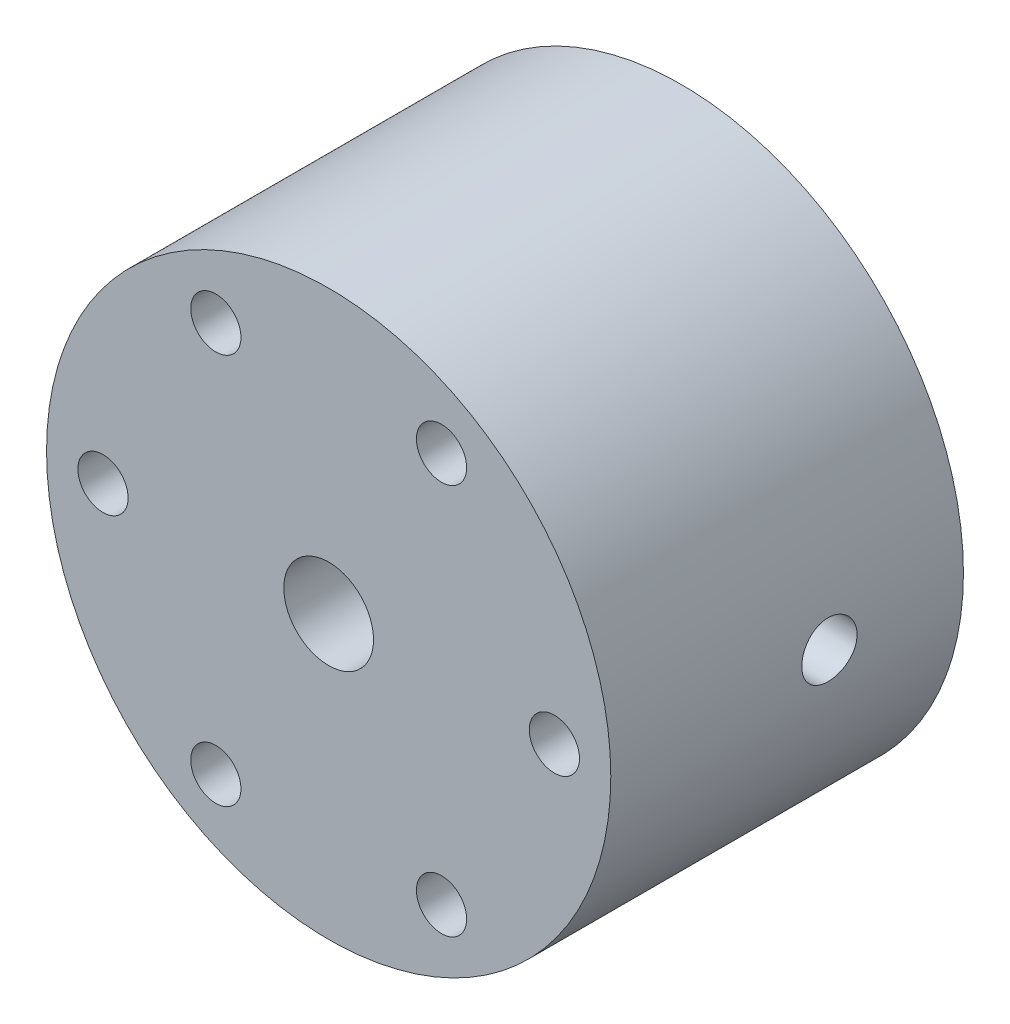
ISO-10303-21;
HEADER;
FILE_DESCRIPTION(('STEP AP214'),'2;1');
FILE_NAME('part.step','',(''),(''),'','','');
FILE_SCHEMA(('AUTOMOTIVE_DESIGN { 1 0 10303 214 1 1 1 1 }'));
ENDSEC;
DATA;
#1=APPLICATION_CONTEXT('core data for automotive mechanical design processes');
#2=APPLICATION_PROTOCOL_DEFINITION('international standard','automotive_design',2000,#1);
#3=PRODUCT_CONTEXT('',#1,'mechanical');
#4=PRODUCT('Part','Part','',(#3));
#5=PRODUCT_RELATED_PRODUCT_CATEGORY('part','',(#4));
#6=PRODUCT_DEFINITION_FORMATION('','',#4);
#7=PRODUCT_DEFINITION_CONTEXT('part definition',#1,'design');
#8=PRODUCT_DEFINITION('design','',#6,#7);
#9=PRODUCT_DEFINITION_SHAPE('','',#8);
#10=(LENGTH_UNIT() NAMED_UNIT(*) SI_UNIT(.MILLI.,.METRE.));
#11=(NAMED_UNIT(*) PLANE_ANGLE_UNIT() SI_UNIT($,.RADIAN.));
#12=(NAMED_UNIT(*) SI_UNIT($,.STERADIAN.) SOLID_ANGLE_UNIT());
#13=UNCERTAINTY_MEASURE_WITH_UNIT(LENGTH_MEASURE(1.E-05),#10,'distance_accuracy_value','');
#14=(GEOMETRIC_REPRESENTATION_CONTEXT(3) GLOBAL_UNCERTAINTY_ASSIGNED_CONTEXT((#13)) GLOBAL_UNIT_ASSIGNED_CONTEXT((#10,
#11,#12)) REPRESENTATION_CONTEXT('',''));
#15=CARTESIAN_POINT('',(0.,0.,0.));
#16=DIRECTION('',(0.,0.,1.));
#17=DIRECTION('',(1.,0.,0.));
#18=AXIS2_PLACEMENT_3D('',#15,#16,#17);
#19=CARTESIAN_POINT('',(0.,0.,-15.875));
#20=DIRECTION('',(0.,0.,1.));
#21=DIRECTION('',(1.,0.,0.));
#22=AXIS2_PLACEMENT_3D('',#19,#20,#21);
#23=CYLINDRICAL_SURFACE('',#22,6.35);
#24=CARTESIAN_POINT('',(6.35,0.,-11.0871));
#25=CARTESIAN_POINT('',(6.34999873012155,0.0691998501132355,-11.0870974209537));
#26=CARTESIAN_POINT('',(6.34885719759817,0.138432610376047,-11.0813092242111));
#27=CARTESIAN_POINT('',(6.34441347981327,0.274943160789766,-11.0583266188072));
#28=CARTESIAN_POINT('',(6.34110954309524,0.342219320002634,-11.0411229639482));
#29=CARTESIAN_POINT('',(6.33271016310304,0.472823044159895,-10.9958597295527));
#30=CARTESIAN_POINT('',(6.32761640429846,0.53615425609475,-10.9678103548511));
#31=CARTESIAN_POINT('',(6.31619193322287,0.657206847462699,-10.9016817866678));
#32=CARTESIAN_POINT('',(6.30986130322098,0.714928599620654,-10.8636032602054));
#33=CARTESIAN_POINT('',(6.29656824686096,0.823880845142603,-10.7779709838292));
#34=CARTESIAN_POINT('',(6.28959930751327,0.875027690644866,-10.7303118068963));
#35=CARTESIAN_POINT('',(6.2758627692415,0.968654169429386,-10.6270977837559));
#36=CARTESIAN_POINT('',(6.26909518565386,1.01113314395148,-10.5715423379742));
#37=CARTESIAN_POINT('',(6.25646410907387,1.08657144827613,-10.4535145404307));
#38=CARTESIAN_POINT('',(6.25060900192882,1.11944466141394,-10.3909861698795));
#39=CARTESIAN_POINT('',(6.24055807849484,1.17418673342534,-10.2611599746295));
#40=CARTESIAN_POINT('',(6.23636210514367,1.19605663398321,-10.1938626021008));
#41=CARTESIAN_POINT('',(6.23017031881125,1.2279007290091,-10.0573071032801));
#42=CARTESIAN_POINT('',(6.22814743858781,1.23802139891786,-9.98808438647694));
#43=CARTESIAN_POINT('',(6.22644936204592,1.24653460768439,-9.84889617228764));
#44=CARTESIAN_POINT('',(6.22677393536207,1.24492829735939,-9.77893074845929));
#45=CARTESIAN_POINT('',(6.22970948404262,1.23015168265358,-9.64131140134532));
#46=CARTESIAN_POINT('',(6.23228734628924,1.21714884796234,-9.5736386849708));
#47=CARTESIAN_POINT('',(6.23938691548407,1.18021243405689,-9.4414542143517));
#48=CARTESIAN_POINT('',(6.24390871193627,1.15627835153526,-9.37694260580546));
#49=CARTESIAN_POINT('',(6.254420759856,1.09799767249771,-9.25242656272007));
#50=CARTESIAN_POINT('',(6.26042038113394,1.06358429192835,-9.19245421072968));
#51=CARTESIAN_POINT('',(6.27320599878303,0.985369043358765,-9.07907245380946));
#52=CARTESIAN_POINT('',(6.27999208204964,0.941566137463435,-9.02566377543969));
#53=CARTESIAN_POINT('',(6.29372972798811,0.844916538812785,-8.92595868997348));
#54=CARTESIAN_POINT('',(6.30068212531286,0.791926810920896,-8.87980093796775));
#55=CARTESIAN_POINT('',(6.31386166816775,0.678884150310218,-8.79700789674848));
#56=CARTESIAN_POINT('',(6.32008880508828,0.618831133759667,-8.76037272057173));
#57=CARTESIAN_POINT('',(6.33113058236044,0.493215629932089,-8.69764083054893));
#58=CARTESIAN_POINT('',(6.33594315811733,0.427645267570471,-8.6715594996653));
#59=CARTESIAN_POINT('',(6.34359780845824,0.292938439507332,-8.63082098362483));
#60=CARTESIAN_POINT('',(6.34644011211744,0.22380238937774,-8.61616247036086));
#61=CARTESIAN_POINT('',(6.34980220790728,0.0851186705623439,-8.59888091246443));
#62=CARTESIAN_POINT('',(6.35035862750085,0.0155955163376805,-8.59606804268317));
#63=CARTESIAN_POINT('',(6.34918781510507,-0.122927488033901,-8.60204706092497));
#64=CARTESIAN_POINT('',(6.34746070618331,-0.191927366180502,-8.6108383235594));
#65=CARTESIAN_POINT('',(6.34193978026486,-0.326836136791517,-8.63961830912908));
#66=CARTESIAN_POINT('',(6.33816386674663,-0.392766510365615,-8.65951007259558));
#67=CARTESIAN_POINT('',(6.32896709967917,-0.520356198148685,-8.70982078883336));
#68=CARTESIAN_POINT('',(6.32354612657694,-0.582015201540064,-8.74024050673549));
#69=CARTESIAN_POINT('',(6.31156927749776,-0.700115568487912,-8.81115737797906));
#70=CARTESIAN_POINT('',(6.30500074680334,-0.756486661307009,-8.85176937375335));
#71=CARTESIAN_POINT('',(6.29148807323559,-0.861681874142545,-8.94176367409749));
#72=CARTESIAN_POINT('',(6.28454389184814,-0.910505218328306,-8.9911468791375));
#73=CARTESIAN_POINT('',(6.27093974032093,-0.99994795805695,-9.09814440742536));
#74=CARTESIAN_POINT('',(6.26428539402094,-1.04043728477614,-9.15586829667224));
#75=CARTESIAN_POINT('',(6.25213149599816,-1.11114544411007,-9.2774095293561));
#76=CARTESIAN_POINT('',(6.24663189907206,-1.14136467878194,-9.34122663412844));
#77=CARTESIAN_POINT('',(6.23745518480048,-1.19049501994089,-9.47282725824857));
#78=CARTESIAN_POINT('',(6.23376883878759,-1.20946349180449,-9.54058868739862));
#79=CARTESIAN_POINT('',(6.22861594327845,-1.23572884377986,-9.67841658909591));
#80=CARTESIAN_POINT('',(6.22714911718908,-1.24302717821246,-9.74848277331608));
#81=CARTESIAN_POINT('',(6.22661626675921,-1.24569293269772,-9.88762636919756));
#82=CARTESIAN_POINT('',(6.2275089084143,-1.24126576164126,-9.95669976970301));
#83=CARTESIAN_POINT('',(6.2315022909027,-1.2210583329774,-10.0930970135399));
#84=CARTESIAN_POINT('',(6.23460301553487,-1.20527815866932,-10.1604208697043));
#85=CARTESIAN_POINT('',(6.24264505758529,-1.16290269218004,-10.2912838437574));
#86=CARTESIAN_POINT('',(6.24758224951711,-1.13633162873382,-10.3548310772359));
#87=CARTESIAN_POINT('',(6.25874346205361,-1.07315184055403,-10.4765979171228));
#88=CARTESIAN_POINT('',(6.26496758506504,-1.03654231694056,-10.5348170990225));
#89=CARTESIAN_POINT('',(6.27812843065338,-0.953619144695071,-10.6453000356421));
#90=CARTESIAN_POINT('',(6.2850751310879,-0.907156775509196,-10.6974509993114));
#91=CARTESIAN_POINT('',(6.29882582082589,-0.80615488032314,-10.7932842554086));
#92=CARTESIAN_POINT('',(6.30562977697998,-0.75161350133508,-10.8369645997084));
#93=CARTESIAN_POINT('',(6.31840829415792,-0.635348303444653,-10.9150269557025));
#94=CARTESIAN_POINT('',(6.32437390028101,-0.573558237015134,-10.9493118209264));
#95=CARTESIAN_POINT('',(6.33471566568597,-0.444995341399583,-11.0069577053639));
#96=CARTESIAN_POINT('',(6.33909327657429,-0.378227130460409,-11.0303287067229));
#97=CARTESIAN_POINT('',(6.34490158522081,-0.259411241495006,-11.0608853429375));
#98=CARTESIAN_POINT('',(6.34680243056367,-0.208046084289743,-11.0706985518169));
#99=CARTESIAN_POINT('',(6.34935209870376,-0.104460186105825,-11.0838067571417));
#100=CARTESIAN_POINT('',(6.35000095864048,-0.0522394705532053,-11.0871019469408));
#101=CARTESIAN_POINT('',(6.35,0.,-11.0871));
#102=B_SPLINE_CURVE_WITH_KNOTS('',3,(#24,#25,#26,#27,#28,#29,#30,#31,#32,#33,#34,#35,#36,#37,
#38,#39,#40,#41,#42,#43,#44,#45,#46,#47,#48,#49,#50,#51,#52,#53,#54,#55,#56,#57,#58,#59,#60,#61,
#62,#63,#64,#65,#66,#67,#68,#69,#70,#71,#72,#73,#74,#75,#76,#77,#78,#79,#80,#81,#82,#83,#84,#85,
#86,#87,#88,#89,#90,#91,#92,#93,#94,#95,#96,#97,#98,#99,#100,#101),.UNSPECIFIED.,.T.,.F.,(4,2,2,
2,2,2,2,2,2,2,2,2,2,2,2,2,2,2,2,2,2,2,2,2,2,2,2,2,2,2,2,2,2,2,2,2,2,2,4),(0.,0.207408463978585,
0.414985128339295,0.622366955369227,0.829734993319364,1.03952391068284,1.24932876611809,
1.46096057052009,1.67257233595457,1.88151664392526,2.09044044759978,2.29634468017157,
2.50225839414703,2.70951286970568,2.91679026649026,3.127644957244,3.33850215081265,
3.54966558582393,3.76080446563934,3.96854668008172,4.17627769900241,4.38222202782779,
4.58818132703138,4.79657456243934,5.00498920429922,5.21644418894365,5.42789089452113,
5.63824999537865,5.84858287945242,6.05525559984227,6.26192680384763,6.4681365131003,
6.67436263768217,6.88395679393226,7.09359909698881,7.3053335999546,7.51687406308761,
7.67345286716177,7.83002702633646),.UNSPECIFIED.);
#103=CARTESIAN_POINT('',(6.35,0.,-11.0871));
#104=VERTEX_POINT('',#103);
#105=EDGE_CURVE('E132',#104,#104,#102,.T.);
#106=ORIENTED_EDGE('',*,*,#105,.T.);
#107=EDGE_LOOP('',(#106));
#108=FACE_BOUND('',#107,.T.);
#109=CARTESIAN_POINT('',(-6.35,0.,-11.0871));
#110=CARTESIAN_POINT('',(-6.34999873012155,-0.0691998501132355,-11.0870974209537));
#111=CARTESIAN_POINT('',(-6.34885719759817,-0.138432610376047,-11.0813092242111));
#112=CARTESIAN_POINT('',(-6.34441347981327,-0.274943160789766,-11.0583266188072));
#113=CARTESIAN_POINT('',(-6.34110954309524,-0.342219320002634,-11.0411229639482));
#114=CARTESIAN_POINT('',(-6.33271016310304,-0.472823044159895,-10.9958597295527));
#115=CARTESIAN_POINT('',(-6.32761640429846,-0.53615425609475,-10.9678103548511));
#116=CARTESIAN_POINT('',(-6.31619193322287,-0.657206847462699,-10.9016817866678));
#117=CARTESIAN_POINT('',(-6.30986130322098,-0.714928599620654,-10.8636032602054));
#118=CARTESIAN_POINT('',(-6.29656824686096,-0.823880845142603,-10.7779709838292));
#119=CARTESIAN_POINT('',(-6.28959930751327,-0.875027690644866,-10.7303118068963));
#120=CARTESIAN_POINT('',(-6.2758627692415,-0.968654169429386,-10.6270977837559));
#121=CARTESIAN_POINT('',(-6.26909518565386,-1.01113314395148,-10.5715423379742));
#122=CARTESIAN_POINT('',(-6.25646410907387,-1.08657144827613,-10.4535145404307));
#123=CARTESIAN_POINT('',(-6.25060900192882,-1.11944466141394,-10.3909861698795));
#124=CARTESIAN_POINT('',(-6.24055807849484,-1.17418673342534,-10.2611599746295));
#125=CARTESIAN_POINT('',(-6.23636210514367,-1.19605663398321,-10.1938626021008));
#126=CARTESIAN_POINT('',(-6.23017031881125,-1.2279007290091,-10.0573071032801));
#127=CARTESIAN_POINT('',(-6.22814743858781,-1.23802139891786,-9.98808438647694));
#128=CARTESIAN_POINT('',(-6.22644936204592,-1.24653460768439,-9.84889617228764));
#129=CARTESIAN_POINT('',(-6.22677393536207,-1.24492829735939,-9.77893074845929));
#130=CARTESIAN_POINT('',(-6.22970948404262,-1.23015168265358,-9.64131140134532));
#131=CARTESIAN_POINT('',(-6.23228734628924,-1.21714884796234,-9.5736386849708));
#132=CARTESIAN_POINT('',(-6.23938691548407,-1.18021243405689,-9.4414542143517));
#133=CARTESIAN_POINT('',(-6.24390871193627,-1.15627835153526,-9.37694260580546));
#134=CARTESIAN_POINT('',(-6.254420759856,-1.09799767249771,-9.25242656272007));
#135=CARTESIAN_POINT('',(-6.26042038113394,-1.06358429192835,-9.19245421072968));
#136=CARTESIAN_POINT('',(-6.27320599878303,-0.985369043358765,-9.07907245380946));
#137=CARTESIAN_POINT('',(-6.27999208204964,-0.941566137463435,-9.02566377543969));
#138=CARTESIAN_POINT('',(-6.29372972798811,-0.844916538812785,-8.92595868997348));
#139=CARTESIAN_POINT('',(-6.30068212531286,-0.791926810920896,-8.87980093796775));
#140=CARTESIAN_POINT('',(-6.31386166816775,-0.678884150310218,-8.79700789674848));
#141=CARTESIAN_POINT('',(-6.32008880508828,-0.618831133759667,-8.76037272057173));
#142=CARTESIAN_POINT('',(-6.33113058236044,-0.493215629932089,-8.69764083054893));
#143=CARTESIAN_POINT('',(-6.33594315811733,-0.427645267570471,-8.6715594996653));
#144=CARTESIAN_POINT('',(-6.34359780845824,-0.292938439507332,-8.63082098362483));
#145=CARTESIAN_POINT('',(-6.34644011211744,-0.22380238937774,-8.61616247036086));
#146=CARTESIAN_POINT('',(-6.34980220790728,-0.0851186705623439,-8.59888091246443));
#147=CARTESIAN_POINT('',(-6.35035862750085,-0.0155955163376805,-8.59606804268317));
#148=CARTESIAN_POINT('',(-6.34918781510507,0.122927488033901,-8.60204706092497));
#149=CARTESIAN_POINT('',(-6.34746070618331,0.191927366180502,-8.6108383235594));
#150=CARTESIAN_POINT('',(-6.34193978026486,0.326836136791517,-8.63961830912908));
#151=CARTESIAN_POINT('',(-6.33816386674663,0.392766510365615,-8.65951007259558));
#152=CARTESIAN_POINT('',(-6.32896709967917,0.520356198148685,-8.70982078883336));
#153=CARTESIAN_POINT('',(-6.32354612657694,0.582015201540064,-8.74024050673549));
#154=CARTESIAN_POINT('',(-6.31156927749776,0.700115568487912,-8.81115737797906));
#155=CARTESIAN_POINT('',(-6.30500074680334,0.756486661307009,-8.85176937375335));
#156=CARTESIAN_POINT('',(-6.29148807323559,0.861681874142545,-8.94176367409749));
#157=CARTESIAN_POINT('',(-6.28454389184814,0.910505218328306,-8.9911468791375));
#158=CARTESIAN_POINT('',(-6.27093974032093,0.99994795805695,-9.09814440742536));
#159=CARTESIAN_POINT('',(-6.26428539402094,1.04043728477614,-9.15586829667224));
#160=CARTESIAN_POINT('',(-6.25213149599816,1.11114544411007,-9.2774095293561));
#161=CARTESIAN_POINT('',(-6.24663189907206,1.14136467878194,-9.34122663412844));
#162=CARTESIAN_POINT('',(-6.23745518480048,1.19049501994089,-9.47282725824857));
#163=CARTESIAN_POINT('',(-6.23376883878759,1.20946349180449,-9.54058868739862));
#164=CARTESIAN_POINT('',(-6.22861594327845,1.23572884377986,-9.67841658909591));
#165=CARTESIAN_POINT('',(-6.22714911718908,1.24302717821246,-9.74848277331608));
#166=CARTESIAN_POINT('',(-6.22661626675921,1.24569293269772,-9.88762636919756));
#167=CARTESIAN_POINT('',(-6.2275089084143,1.24126576164126,-9.95669976970301));
#168=CARTESIAN_POINT('',(-6.2315022909027,1.2210583329774,-10.0930970135399));
#169=CARTESIAN_POINT('',(-6.23460301553487,1.20527815866932,-10.1604208697043));
#170=CARTESIAN_POINT('',(-6.24264505758529,1.16290269218004,-10.2912838437574));
#171=CARTESIAN_POINT('',(-6.24758224951711,1.13633162873382,-10.3548310772359));
#172=CARTESIAN_POINT('',(-6.25874346205361,1.07315184055403,-10.4765979171228));
#173=CARTESIAN_POINT('',(-6.26496758506504,1.03654231694056,-10.5348170990225));
#174=CARTESIAN_POINT('',(-6.27812843065338,0.953619144695071,-10.6453000356421));
#175=CARTESIAN_POINT('',(-6.2850751310879,0.907156775509196,-10.6974509993114));
#176=CARTESIAN_POINT('',(-6.29882582082589,0.80615488032314,-10.7932842554086));
#177=CARTESIAN_POINT('',(-6.30562977697998,0.75161350133508,-10.8369645997084));
#178=CARTESIAN_POINT('',(-6.31840829415792,0.635348303444653,-10.9150269557025));
#179=CARTESIAN_POINT('',(-6.32437390028101,0.573558237015134,-10.9493118209264));
#180=CARTESIAN_POINT('',(-6.33471566568597,0.444995341399583,-11.0069577053639));
#181=CARTESIAN_POINT('',(-6.33909327657429,0.378227130460409,-11.0303287067229));
#182=CARTESIAN_POINT('',(-6.34490158522081,0.259411241495006,-11.0608853429375));
#183=CARTESIAN_POINT('',(-6.34680243056367,0.208046084289743,-11.0706985518169));
#184=CARTESIAN_POINT('',(-6.34935209870376,0.104460186105825,-11.0838067571417));
#185=CARTESIAN_POINT('',(-6.35000095864048,0.0522394705532053,-11.0871019469408));
#186=CARTESIAN_POINT('',(-6.35,0.,-11.0871));
#187=B_SPLINE_CURVE_WITH_KNOTS('',3,(#109,#110,#111,#112,#113,#114,#115,#116,#117,#118,#119,
#120,#121,#122,#123,#124,#125,#126,#127,#128,#129,#130,#131,#132,#133,#134,#135,#136,#137,#138,
#139,#140,#141,#142,#143,#144,#145,#146,#147,#148,#149,#150,#151,#152,#153,#154,#155,#156,#157,
#158,#159,#160,#161,#162,#163,#164,#165,#166,#167,#168,#169,#170,#171,#172,#173,#174,#175,#176,
#177,#178,#179,#180,#181,#182,#183,#184,#185,#186),.UNSPECIFIED.,.T.,.F.,(4,2,2,2,2,2,2,2,2,2,2,
2,2,2,2,2,2,2,2,2,2,2,2,2,2,2,2,2,2,2,2,2,2,2,2,2,2,2,4),(0.,0.207408463978585,
0.414985128339295,0.622366955369227,0.829734993319364,1.03952391068284,1.24932876611809,
1.46096057052009,1.67257233595457,1.88151664392526,2.09044044759978,2.29634468017157,
2.50225839414703,2.70951286970568,2.91679026649026,3.127644957244,3.33850215081265,
3.54966558582393,3.76080446563934,3.96854668008172,4.17627769900241,4.38222202782779,
4.58818132703138,4.79657456243934,5.00498920429922,5.21644418894365,5.42789089452113,
5.63824999537865,5.84858287945242,6.05525559984227,6.26192680384763,6.4681365131003,
6.67436263768217,6.88395679393226,7.09359909698881,7.3053335999546,7.51687406308761,
7.67345286716177,7.83002702633646),.UNSPECIFIED.);
#188=CARTESIAN_POINT('',(-6.35,0.,-11.0871));
#189=VERTEX_POINT('',#188);
#190=EDGE_CURVE('E121',#189,#189,#187,.T.);
#191=ORIENTED_EDGE('',*,*,#190,.T.);
#192=EDGE_LOOP('',(#191));
#193=FACE_BOUND('',#192,.T.);
#194=CARTESIAN_POINT('',(0.,0.,-6.35));
#195=DIRECTION('',(0.,0.,1.));
#196=DIRECTION('',(1.,0.,0.));
#197=AXIS2_PLACEMENT_3D('',#194,#195,#196);
#198=CIRCLE('',#197,6.35);
#199=CARTESIAN_POINT('',(6.35,0.,-6.35));
#200=VERTEX_POINT('',#199);
#201=EDGE_CURVE('E195',#200,#200,#198,.T.);
#202=ORIENTED_EDGE('',*,*,#201,.T.);
#203=EDGE_LOOP('',(#202));
#204=FACE_BOUND('',#203,.T.);
#205=CARTESIAN_POINT('',(0.,0.,-12.2428));
#206=DIRECTION('',(0.,0.,-1.));
#207=DIRECTION('',(-1.,0.,0.));
#208=AXIS2_PLACEMENT_3D('',#205,#206,#207);
#209=CIRCLE('',#208,6.35);
#210=CARTESIAN_POINT('',(-6.35,0.,-12.2428));
#211=VERTEX_POINT('',#210);
#212=EDGE_CURVE('E111',#211,#211,#209,.T.);
#213=ORIENTED_EDGE('',*,*,#212,.T.);
#214=EDGE_LOOP('',(#213));
#215=FACE_BOUND('',#214,.T.);
#216=ADVANCED_FACE('F33',(#108,#193,#204,#215),#23,.F.);
#217=CARTESIAN_POINT('',(0.,0.,-15.875));
#218=DIRECTION('',(0.,0.,1.));
#219=DIRECTION('',(1.,0.,0.));
#220=AXIS2_PLACEMENT_3D('',#217,#218,#219);
#221=CYLINDRICAL_SURFACE('',#220,12.7);
#222=CARTESIAN_POINT('',(-12.7,0.,-11.0871));
#223=CARTESIAN_POINT('',(-12.6999992118775,-0.0697303020122866,-11.0870969768323));
#224=CARTESIAN_POINT('',(-12.6994196059281,-0.139506883351139,-11.0812201789768));
#225=CARTESIAN_POINT('',(-12.6971631762097,-0.277126072522789,-11.0578649127043));
#226=CARTESIAN_POINT('',(-12.6954851392076,-0.344966455229008,-11.0403736155964));
#227=CARTESIAN_POINT('',(-12.6912212943417,-0.476700422128338,-10.9943029976135));
#228=CARTESIAN_POINT('',(-12.6886360303452,-0.540596344032832,-10.9657303187638));
#229=CARTESIAN_POINT('',(-12.682846918591,-0.662671277813997,-10.8983207751815));
#230=CARTESIAN_POINT('',(-12.6796431950776,-0.720851434411891,-10.8594859714615));
#231=CARTESIAN_POINT('',(-12.6729637160054,-0.830058902227844,-10.7725101281549));
#232=CARTESIAN_POINT('',(-12.6694871535611,-0.88106364807091,-10.724340814659));
#233=CARTESIAN_POINT('',(-12.6626605116109,-0.974278550999365,-10.6201235460222));
#234=CARTESIAN_POINT('',(-12.659310437922,-1.01648830402211,-10.5640752290994));
#235=CARTESIAN_POINT('',(-12.6531077811571,-1.09099453812292,-10.4455502762126));
#236=CARTESIAN_POINT('',(-12.6502562243902,-1.12327067005917,-10.3830607902158));
#237=CARTESIAN_POINT('',(-12.6453833744956,-1.17686351932648,-10.2535165060838));
#238=CARTESIAN_POINT('',(-12.6433620616172,-1.19818049736915,-10.1864618165951));
#239=CARTESIAN_POINT('',(-12.6403857905373,-1.22918320315736,-10.0499202258657));
#240=CARTESIAN_POINT('',(-12.6394274089358,-1.23890627921643,-9.98044188068585));
#241=CARTESIAN_POINT('',(-12.6386748596695,-1.24656062005218,-9.84083332854725));
#242=CARTESIAN_POINT('',(-12.6388806625405,-1.24449218325736,-9.77070313813076));
#243=CARTESIAN_POINT('',(-12.6404301048789,-1.2286530078958,-9.63203889289002));
#244=CARTESIAN_POINT('',(-12.6417697816285,-1.21492302408841,-9.56350013227959));
#245=CARTESIAN_POINT('',(-12.64542983043,-1.17621389945098,-9.42970448403276));
#246=CARTESIAN_POINT('',(-12.6477502152573,-1.15123461208068,-9.36444763916089));
#247=CARTESIAN_POINT('',(-12.6531147910418,-1.09069088173061,-9.23893933628981));
#248=CARTESIAN_POINT('',(-12.6561602183935,-1.05510833093243,-9.17869666828358));
#249=CARTESIAN_POINT('',(-12.6626306779936,-0.974381148951299,-9.06502296653496));
#250=CARTESIAN_POINT('',(-12.6660557209087,-0.929236249049455,-9.01159212428451));
#251=CARTESIAN_POINT('',(-12.6729171493012,-0.830438117724241,-8.91282193675217));
#252=CARTESIAN_POINT('',(-12.6763535214325,-0.776749684832399,-8.86751779451027));
#253=CARTESIAN_POINT('',(-12.682836710536,-0.662510813140447,-8.78655978969558));
#254=CARTESIAN_POINT('',(-12.6858835270972,-0.601960367101508,-8.75090593730316));
#255=CARTESIAN_POINT('',(-12.6912452546113,-0.47569207925777,-8.69026210710699));
#256=CARTESIAN_POINT('',(-12.6935600449764,-0.409973388303858,-8.66527388603299));
#257=CARTESIAN_POINT('',(-12.6971956563466,-0.275245493918393,-8.62669629311965));
#258=CARTESIAN_POINT('',(-12.6985165058958,-0.206236385041384,-8.61310659393697));
#259=CARTESIAN_POINT('',(-12.7000117447929,-0.0671914656119697,-8.59775639826842));
#260=CARTESIAN_POINT('',(-12.7001908427011,0.00283893291063301,-8.59594731808867));
#261=CARTESIAN_POINT('',(-12.6993950179257,0.14220626233575,-8.60408215264171));
#262=CARTESIAN_POINT('',(-12.6984201102051,0.211543202218001,-8.61402591498532));
#263=CARTESIAN_POINT('',(-12.6954288556931,0.347415386450626,-8.64534386702764));
#264=CARTESIAN_POINT('',(-12.6934145790677,0.41395591671114,-8.66669533837271));
#265=CARTESIAN_POINT('',(-12.6885706006033,0.542510674534818,-8.72019928983903));
#266=CARTESIAN_POINT('',(-12.6857408811698,0.604524804397516,-8.75235200301671));
#267=CARTESIAN_POINT('',(-12.6795708991914,0.7224862558398,-8.82666643569343));
#268=CARTESIAN_POINT('',(-12.6762290190811,0.778413360479164,-8.86886010967803));
#269=CARTESIAN_POINT('',(-12.6694149920371,0.882408624170608,-8.96201287867617));
#270=CARTESIAN_POINT('',(-12.6659428419669,0.930476593848541,-9.01297218484617));
#271=CARTESIAN_POINT('',(-12.6592454708017,1.01755753945501,-9.12242150639563));
#272=CARTESIAN_POINT('',(-12.6560211443896,1.05653865326147,-9.1809369346195));
#273=CARTESIAN_POINT('',(-12.6501979750504,1.1241203949023,-9.30371196854814));
#274=CARTESIAN_POINT('',(-12.647599123864,1.15272115981277,-9.36797149838609));
#275=CARTESIAN_POINT('',(-12.643326665565,1.19867687163247,-9.50030091404752));
#276=CARTESIAN_POINT('',(-12.64165149359,1.21605084718545,-9.56836413893747));
#277=CARTESIAN_POINT('',(-12.6394111508632,1.2391215655445,-9.7064589921556));
#278=CARTESIAN_POINT('',(-12.6388459496491,1.24481862881635,-9.77649056641016));
#279=CARTESIAN_POINT('',(-12.6388901572597,1.24436945408861,-9.91621749775135));
#280=CARTESIAN_POINT('',(-12.6394946019183,1.23827326857305,-9.98591302272308));
#281=CARTESIAN_POINT('',(-12.6417994153479,1.21451551564151,-10.1232848320944));
#282=CARTESIAN_POINT('',(-12.6434997854153,1.19685393454406,-10.1909611141051));
#283=CARTESIAN_POINT('',(-12.6478034925059,1.15048040576535,-10.322373440787));
#284=CARTESIAN_POINT('',(-12.6504067153224,1.12176985567768,-10.3861099826164));
#285=CARTESIAN_POINT('',(-12.6562230385521,1.05411858538472,-10.5078673257106));
#286=CARTESIAN_POINT('',(-12.659436134758,1.01517793575284,-10.565888166402));
#287=CARTESIAN_POINT('',(-12.6661264925511,0.927983817209301,-10.6748236075054));
#288=CARTESIAN_POINT('',(-12.6696047765725,0.879693071052605,-10.7257083083032));
#289=CARTESIAN_POINT('',(-12.6764242512472,0.775242733802869,-10.8186744177002));
#290=CARTESIAN_POINT('',(-12.6797654088204,0.719081258260496,-10.8607537120319));
#291=CARTESIAN_POINT('',(-12.6859425507651,0.600335172368841,-10.9349942503077));
#292=CARTESIAN_POINT('',(-12.6887772870911,0.537735276637879,-10.9671311304444));
#293=CARTESIAN_POINT('',(-12.6936085059498,0.408040327631713,-11.0203946923304));
#294=CARTESIAN_POINT('',(-12.6956059355101,0.340950452885164,-11.0415338195428));
#295=CARTESIAN_POINT('',(-12.6980341823808,0.227898896669927,-11.0669161191703));
#296=CARTESIAN_POINT('',(-12.6987679370069,0.182660480748925,-11.0744747693659));
#297=CARTESIAN_POINT('',(-12.6997511038093,0.0916213695101968,-11.084567693208));
#298=CARTESIAN_POINT('',(-12.7000005178854,0.0458206763986976,-11.0871019865623));
#299=CARTESIAN_POINT('',(-12.7,0.,-11.0871));
#300=B_SPLINE_CURVE_WITH_KNOTS('',3,(#222,#223,#224,#225,#226,#227,#228,#229,#230,#231,#232,
#233,#234,#235,#236,#237,#238,#239,#240,#241,#242,#243,#244,#245,#246,#247,#248,#249,#250,#251,
#252,#253,#254,#255,#256,#257,#258,#259,#260,#261,#262,#263,#264,#265,#266,#267,#268,#269,#270,
#271,#272,#273,#274,#275,#276,#277,#278,#279,#280,#281,#282,#283,#284,#285,#286,#287,#288,#289,
#290,#291,#292,#293,#294,#295,#296,#297,#298,#299),.UNSPECIFIED.,.T.,.F.,(4,2,2,2,2,2,2,2,2,2,2,
2,2,2,2,2,2,2,2,2,2,2,2,2,2,2,2,2,2,2,2,2,2,2,2,2,2,2,4),(0.,0.209023589231034,
0.418278438489406,0.627408056675217,0.836495705811907,1.04622686307429,1.25596765375546,
1.46613528427644,1.6762979148057,1.88578168761911,2.0952601586828,2.30400954276648,
2.51276164622489,2.72187231119901,2.93098885333196,3.14099044735331,3.35099226291022,
3.56102865440525,3.77105901385791,3.98022264907491,4.1893835722733,4.39812949750455,
4.60687992709801,4.81630378657599,5.02573269159929,5.23588524778483,5.4460350287325,
5.65582767928566,5.8656145721293,6.07451304805127,6.28341177109341,6.49228407903672,
6.70115494609034,6.91087636148271,7.1206480754811,7.33092983462728,7.54097311071026,
7.67832573264912,7.81567781582469),.UNSPECIFIED.);
#301=CARTESIAN_POINT('',(-12.7,0.,-11.0871));
#302=VERTEX_POINT('',#301);
#303=EDGE_CURVE('E131',#302,#302,#300,.T.);
#304=ORIENTED_EDGE('',*,*,#303,.F.);
#305=EDGE_LOOP('',(#304));
#306=FACE_BOUND('',#305,.T.);
#307=CARTESIAN_POINT('',(12.7,0.,-11.0871));
#308=CARTESIAN_POINT('',(12.6999992118775,0.0697303020122866,-11.0870969768323));
#309=CARTESIAN_POINT('',(12.6994196059281,0.139506883351139,-11.0812201789768));
#310=CARTESIAN_POINT('',(12.6971631762097,0.277126072522789,-11.0578649127043));
#311=CARTESIAN_POINT('',(12.6954851392076,0.344966455229008,-11.0403736155964));
#312=CARTESIAN_POINT('',(12.6912212943417,0.476700422128338,-10.9943029976135));
#313=CARTESIAN_POINT('',(12.6886360303452,0.540596344032832,-10.9657303187638));
#314=CARTESIAN_POINT('',(12.682846918591,0.662671277813997,-10.8983207751815));
#315=CARTESIAN_POINT('',(12.6796431950776,0.720851434411891,-10.8594859714615));
#316=CARTESIAN_POINT('',(12.6729637160054,0.830058902227844,-10.7725101281549));
#317=CARTESIAN_POINT('',(12.6694871535611,0.88106364807091,-10.724340814659));
#318=CARTESIAN_POINT('',(12.6626605116109,0.974278550999365,-10.6201235460222));
#319=CARTESIAN_POINT('',(12.659310437922,1.01648830402211,-10.5640752290994));
#320=CARTESIAN_POINT('',(12.6531077811571,1.09099453812292,-10.4455502762126));
#321=CARTESIAN_POINT('',(12.6502562243902,1.12327067005917,-10.3830607902158));
#322=CARTESIAN_POINT('',(12.6453833744956,1.17686351932648,-10.2535165060838));
#323=CARTESIAN_POINT('',(12.6433620616172,1.19818049736915,-10.1864618165951));
#324=CARTESIAN_POINT('',(12.6403857905373,1.22918320315736,-10.0499202258657));
#325=CARTESIAN_POINT('',(12.6394274089358,1.23890627921643,-9.98044188068585));
#326=CARTESIAN_POINT('',(12.6386748596695,1.24656062005218,-9.84083332854725));
#327=CARTESIAN_POINT('',(12.6388806625405,1.24449218325736,-9.77070313813076));
#328=CARTESIAN_POINT('',(12.6404301048789,1.2286530078958,-9.63203889289002));
#329=CARTESIAN_POINT('',(12.6417697816285,1.21492302408841,-9.56350013227959));
#330=CARTESIAN_POINT('',(12.64542983043,1.17621389945098,-9.42970448403276));
#331=CARTESIAN_POINT('',(12.6477502152573,1.15123461208068,-9.36444763916089));
#332=CARTESIAN_POINT('',(12.6531147910418,1.09069088173061,-9.23893933628981));
#333=CARTESIAN_POINT('',(12.6561602183935,1.05510833093243,-9.17869666828358));
#334=CARTESIAN_POINT('',(12.6626306779936,0.974381148951299,-9.06502296653496));
#335=CARTESIAN_POINT('',(12.6660557209087,0.929236249049455,-9.01159212428451));
#336=CARTESIAN_POINT('',(12.6729171493012,0.830438117724241,-8.91282193675217));
#337=CARTESIAN_POINT('',(12.6763535214325,0.776749684832399,-8.86751779451027));
#338=CARTESIAN_POINT('',(12.682836710536,0.662510813140447,-8.78655978969558));
#339=CARTESIAN_POINT('',(12.6858835270972,0.601960367101508,-8.75090593730316));
#340=CARTESIAN_POINT('',(12.6912452546113,0.47569207925777,-8.69026210710699));
#341=CARTESIAN_POINT('',(12.6935600449764,0.409973388303858,-8.66527388603299));
#342=CARTESIAN_POINT('',(12.6971956563466,0.275245493918393,-8.62669629311965));
#343=CARTESIAN_POINT('',(12.6985165058958,0.206236385041384,-8.61310659393697));
#344=CARTESIAN_POINT('',(12.7000117447929,0.0671914656119697,-8.59775639826842));
#345=CARTESIAN_POINT('',(12.7001908427011,-0.00283893291063301,-8.59594731808867));
#346=CARTESIAN_POINT('',(12.6993950179257,-0.14220626233575,-8.60408215264171));
#347=CARTESIAN_POINT('',(12.6984201102051,-0.211543202218001,-8.61402591498532));
#348=CARTESIAN_POINT('',(12.6954288556931,-0.347415386450626,-8.64534386702764));
#349=CARTESIAN_POINT('',(12.6934145790677,-0.41395591671114,-8.66669533837271));
#350=CARTESIAN_POINT('',(12.6885706006033,-0.542510674534818,-8.72019928983903));
#351=CARTESIAN_POINT('',(12.6857408811698,-0.604524804397516,-8.75235200301671));
#352=CARTESIAN_POINT('',(12.6795708991914,-0.7224862558398,-8.82666643569343));
#353=CARTESIAN_POINT('',(12.6762290190811,-0.778413360479164,-8.86886010967803));
#354=CARTESIAN_POINT('',(12.6694149920371,-0.882408624170608,-8.96201287867617));
#355=CARTESIAN_POINT('',(12.6659428419669,-0.930476593848541,-9.01297218484617));
#356=CARTESIAN_POINT('',(12.6592454708017,-1.01755753945501,-9.12242150639563));
#357=CARTESIAN_POINT('',(12.6560211443896,-1.05653865326147,-9.1809369346195));
#358=CARTESIAN_POINT('',(12.6501979750504,-1.1241203949023,-9.30371196854814));
#359=CARTESIAN_POINT('',(12.647599123864,-1.15272115981277,-9.36797149838609));
#360=CARTESIAN_POINT('',(12.643326665565,-1.19867687163247,-9.50030091404752));
#361=CARTESIAN_POINT('',(12.64165149359,-1.21605084718545,-9.56836413893747));
#362=CARTESIAN_POINT('',(12.6394111508632,-1.2391215655445,-9.7064589921556));
#363=CARTESIAN_POINT('',(12.6388459496491,-1.24481862881635,-9.77649056641016));
#364=CARTESIAN_POINT('',(12.6388901572597,-1.24436945408861,-9.91621749775135));
#365=CARTESIAN_POINT('',(12.6394946019183,-1.23827326857305,-9.98591302272308));
#366=CARTESIAN_POINT('',(12.6417994153479,-1.21451551564151,-10.1232848320944));
#367=CARTESIAN_POINT('',(12.6434997854153,-1.19685393454406,-10.1909611141051));
#368=CARTESIAN_POINT('',(12.6478034925059,-1.15048040576535,-10.322373440787));
#369=CARTESIAN_POINT('',(12.6504067153224,-1.12176985567768,-10.3861099826164));
#370=CARTESIAN_POINT('',(12.6562230385521,-1.05411858538472,-10.5078673257106));
#371=CARTESIAN_POINT('',(12.659436134758,-1.01517793575284,-10.565888166402));
#372=CARTESIAN_POINT('',(12.6661264925511,-0.927983817209301,-10.6748236075054));
#373=CARTESIAN_POINT('',(12.6696047765725,-0.879693071052605,-10.7257083083032));
#374=CARTESIAN_POINT('',(12.6764242512472,-0.775242733802869,-10.8186744177002));
#375=CARTESIAN_POINT('',(12.6797654088204,-0.719081258260496,-10.8607537120319));
#376=CARTESIAN_POINT('',(12.6859425507651,-0.600335172368841,-10.9349942503077));
#377=CARTESIAN_POINT('',(12.6887772870911,-0.537735276637879,-10.9671311304444));
#378=CARTESIAN_POINT('',(12.6936085059498,-0.408040327631713,-11.0203946923304));
#379=CARTESIAN_POINT('',(12.6956059355101,-0.340950452885164,-11.0415338195428));
#380=CARTESIAN_POINT('',(12.6980341823808,-0.227898896669927,-11.0669161191703));
#381=CARTESIAN_POINT('',(12.6987679370069,-0.182660480748925,-11.0744747693659));
#382=CARTESIAN_POINT('',(12.6997511038093,-0.0916213695101968,-11.084567693208));
#383=CARTESIAN_POINT('',(12.7000005178854,-0.0458206763986976,-11.0871019865623));
#384=CARTESIAN_POINT('',(12.7,0.,-11.0871));
#385=B_SPLINE_CURVE_WITH_KNOTS('',3,(#307,#308,#309,#310,#311,#312,#313,#314,#315,#316,#317,
#318,#319,#320,#321,#322,#323,#324,#325,#326,#327,#328,#329,#330,#331,#332,#333,#334,#335,#336,
#337,#338,#339,#340,#341,#342,#343,#344,#345,#346,#347,#348,#349,#350,#351,#352,#353,#354,#355,
#356,#357,#358,#359,#360,#361,#362,#363,#364,#365,#366,#367,#368,#369,#370,#371,#372,#373,#374,
#375,#376,#377,#378,#379,#380,#381,#382,#383,#384),.UNSPECIFIED.,.T.,.F.,(4,2,2,2,2,2,2,2,2,2,2,
2,2,2,2,2,2,2,2,2,2,2,2,2,2,2,2,2,2,2,2,2,2,2,2,2,2,2,4),(0.,0.209023589231034,
0.418278438489406,0.627408056675217,0.836495705811907,1.04622686307429,1.25596765375546,
1.46613528427644,1.6762979148057,1.88578168761911,2.0952601586828,2.30400954276648,
2.51276164622489,2.72187231119901,2.93098885333196,3.14099044735331,3.35099226291022,
3.56102865440525,3.77105901385791,3.98022264907491,4.1893835722733,4.39812949750455,
4.60687992709801,4.81630378657599,5.02573269159929,5.23588524778483,5.4460350287325,
5.65582767928566,5.8656145721293,6.07451304805127,6.28341177109341,6.49228407903672,
6.70115494609034,6.91087636148271,7.1206480754811,7.33092983462728,7.54097311071026,
7.67832573264912,7.81567781582469),.UNSPECIFIED.);
#386=CARTESIAN_POINT('',(12.7,0.,-11.0871));
#387=VERTEX_POINT('',#386);
#388=EDGE_CURVE('E124',#387,#387,#385,.T.);
#389=ORIENTED_EDGE('',*,*,#388,.F.);
#390=EDGE_LOOP('',(#389));
#391=FACE_BOUND('',#390,.T.);
#392=CARTESIAN_POINT('',(0.,0.,-15.875));
#393=DIRECTION('',(0.,0.,1.));
#394=DIRECTION('',(1.,0.,0.));
#395=AXIS2_PLACEMENT_3D('',#392,#393,#394);
#396=CIRCLE('',#395,12.7);
#397=CARTESIAN_POINT('',(12.7,0.,-15.875));
#398=VERTEX_POINT('',#397);
#399=EDGE_CURVE('E11',#398,#398,#396,.T.);
#400=ORIENTED_EDGE('',*,*,#399,.T.);
#401=EDGE_LOOP('',(#400));
#402=FACE_BOUND('',#401,.T.);
#403=CARTESIAN_POINT('',(0.,0.,0.));
#404=DIRECTION('',(0.,0.,1.));
#405=DIRECTION('',(1.,0.,0.));
#406=AXIS2_PLACEMENT_3D('',#403,#404,#405);
#407=CIRCLE('',#406,12.7);
#408=CARTESIAN_POINT('',(12.7,0.,0.));
#409=VERTEX_POINT('',#408);
#410=EDGE_CURVE('E43',#409,#409,#407,.T.);
#411=ORIENTED_EDGE('',*,*,#410,.F.);
#412=EDGE_LOOP('',(#411));
#413=FACE_BOUND('',#412,.T.);
#414=ADVANCED_FACE('F35',(#306,#391,#402,#413),#221,.T.);
#415=CARTESIAN_POINT('',(0.,0.,-15.875));
#416=DIRECTION('',(0.,0.,1.));
#417=DIRECTION('',(1.,0.,0.));
#418=AXIS2_PLACEMENT_3D('',#415,#416,#417);
#419=PLANE('',#418);
#420=CARTESIAN_POINT('',(0.,0.,-15.875));
#421=DIRECTION('',(0.,0.,1.));
#422=DIRECTION('',(1.,0.,0.));
#423=AXIS2_PLACEMENT_3D('',#420,#421,#422);
#424=CIRCLE('',#423,6.35);
#425=CARTESIAN_POINT('',(6.35,0.,-15.875));
#426=VERTEX_POINT('',#425);
#427=EDGE_CURVE('E193',#426,#426,#424,.T.);
#428=ORIENTED_EDGE('',*,*,#427,.T.);
#429=EDGE_LOOP('',(#428));
#430=FACE_BOUND('',#429,.T.);
#431=ORIENTED_EDGE('',*,*,#399,.F.);
#432=EDGE_LOOP('',(#431));
#433=FACE_BOUND('',#432,.T.);
#434=ADVANCED_FACE('F180',(#430,#433),#419,.F.);
#435=CARTESIAN_POINT('',(0.,0.,0.));
#436=DIRECTION('',(0.,0.,1.));
#437=DIRECTION('',(1.,0.,0.));
#438=AXIS2_PLACEMENT_3D('',#435,#436,#437);
#439=PLANE('',#438);
#440=CARTESIAN_POINT('',(-5.0800000000001,-8.79881810244984,0.));
#441=DIRECTION('',(0.,0.,1.));
#442=DIRECTION('',(1.,0.,0.));
#443=AXIS2_PLACEMENT_3D('',#440,#441,#442);
#444=CIRCLE('',#443,1.13029999999999);
#445=CARTESIAN_POINT('',(-3.94970000000011,-8.79881810244984,0.));
#446=VERTEX_POINT('',#445);
#447=EDGE_CURVE('E74',#446,#446,#444,.T.);
#448=ORIENTED_EDGE('',*,*,#447,.F.);
#449=EDGE_LOOP('',(#448));
#450=FACE_BOUND('',#449,.T.);
#451=CARTESIAN_POINT('',(5.07999999999992,-8.79881810244994,0.));
#452=DIRECTION('',(0.,0.,1.));
#453=DIRECTION('',(1.,0.,0.));
#454=AXIS2_PLACEMENT_3D('',#451,#452,#453);
#455=CIRCLE('',#454,1.13029999999999);
#456=CARTESIAN_POINT('',(6.21029999999991,-8.79881810244994,0.));
#457=VERTEX_POINT('',#456);
#458=EDGE_CURVE('E73',#457,#457,#455,.T.);
#459=ORIENTED_EDGE('',*,*,#458,.F.);
#460=EDGE_LOOP('',(#459));
#461=FACE_BOUND('',#460,.T.);
#462=CARTESIAN_POINT('',(10.16,0.,0.));
#463=DIRECTION('',(0.,0.,1.));
#464=DIRECTION('',(1.,0.,0.));
#465=AXIS2_PLACEMENT_3D('',#462,#463,#464);
#466=CIRCLE('',#465,1.13029999999999);
#467=CARTESIAN_POINT('',(11.2903,0.,0.));
#468=VERTEX_POINT('',#467);
#469=EDGE_CURVE('E84',#468,#468,#466,.T.);
#470=ORIENTED_EDGE('',*,*,#469,.F.);
#471=EDGE_LOOP('',(#470));
#472=FACE_BOUND('',#471,.T.);
#473=CARTESIAN_POINT('',(5.08000000000004,8.79881810244988,0.));
#474=DIRECTION('',(0.,0.,1.));
#475=DIRECTION('',(1.,0.,0.));
#476=AXIS2_PLACEMENT_3D('',#473,#474,#475);
#477=CIRCLE('',#476,1.13029999999999);
#478=CARTESIAN_POINT('',(6.21030000000003,8.79881810244988,0.));
#479=VERTEX_POINT('',#478);
#480=EDGE_CURVE('E90',#479,#479,#477,.T.);
#481=ORIENTED_EDGE('',*,*,#480,.F.);
#482=EDGE_LOOP('',(#481));
#483=FACE_BOUND('',#482,.T.);
#484=CARTESIAN_POINT('',(-5.07999999999998,8.79881810244991,0.));
#485=DIRECTION('',(0.,0.,1.));
#486=DIRECTION('',(1.,0.,0.));
#487=AXIS2_PLACEMENT_3D('',#484,#485,#486);
#488=CIRCLE('',#487,1.13029999999999);
#489=CARTESIAN_POINT('',(-3.94969999999999,8.79881810244991,0.));
#490=VERTEX_POINT('',#489);
#491=EDGE_CURVE('E96',#490,#490,#488,.T.);
#492=ORIENTED_EDGE('',*,*,#491,.F.);
#493=EDGE_LOOP('',(#492));
#494=FACE_BOUND('',#493,.T.);
#495=CARTESIAN_POINT('',(-10.16,0.,0.));
#496=DIRECTION('',(0.,0.,1.));
#497=DIRECTION('',(1.,0.,0.));
#498=AXIS2_PLACEMENT_3D('',#495,#496,#497);
#499=CIRCLE('',#498,1.13029999999999);
#500=CARTESIAN_POINT('',(-9.02970000000001,0.,0.));
#501=VERTEX_POINT('',#500);
#502=EDGE_CURVE('E102',#501,#501,#499,.T.);
#503=ORIENTED_EDGE('',*,*,#502,.F.);
#504=EDGE_LOOP('',(#503));
#505=FACE_BOUND('',#504,.T.);
#506=CARTESIAN_POINT('',(0.,0.,0.));
#507=DIRECTION('',(0.,0.,1.));
#508=DIRECTION('',(1.,0.,0.));
#509=AXIS2_PLACEMENT_3D('',#506,#507,#508);
#510=CIRCLE('',#509,2.0193);
#511=CARTESIAN_POINT('',(2.0193,0.,0.));
#512=VERTEX_POINT('',#511);
#513=EDGE_CURVE('E108',#512,#512,#510,.T.);
#514=ORIENTED_EDGE('',*,*,#513,.F.);
#515=EDGE_LOOP('',(#514));
#516=FACE_BOUND('',#515,.T.);
#517=ORIENTED_EDGE('',*,*,#410,.T.);
#518=EDGE_LOOP('',(#517));
#519=FACE_BOUND('',#518,.T.);
#520=ADVANCED_FACE('F183',(#450,#461,#472,#483,#494,#505,#516,#519),#439,.T.);
#521=CARTESIAN_POINT('',(0.,0.,-14.605));
#522=DIRECTION('',(0.,0.,-1.));
#523=DIRECTION('',(-1.,0.,0.));
#524=AXIS2_PLACEMENT_3D('',#521,#522,#523);
#525=CIRCLE('',#524,6.35);
#526=CARTESIAN_POINT('',(-6.35,0.,-14.605));
#527=VERTEX_POINT('',#526);
#528=EDGE_CURVE('E115',#527,#527,#525,.T.);
#529=ORIENTED_EDGE('',*,*,#528,.F.);
#530=EDGE_LOOP('',(#529));
#531=FACE_BOUND('',#530,.T.);
#532=ORIENTED_EDGE('',*,*,#427,.F.);
#533=EDGE_LOOP('',(#532));
#534=FACE_BOUND('',#533,.T.);
#535=ADVANCED_FACE('F146',(#531,#534),#23,.F.);
#536=CARTESIAN_POINT('',(0.,0.,-6.35));
#537=DIRECTION('',(0.,0.,1.));
#538=DIRECTION('',(1.,0.,0.));
#539=AXIS2_PLACEMENT_3D('',#536,#537,#538);
#540=PLANE('',#539);
#541=CARTESIAN_POINT('',(0.,0.,-6.35));
#542=DIRECTION('',(0.,0.,1.));
#543=DIRECTION('',(1.,0.,0.));
#544=AXIS2_PLACEMENT_3D('',#541,#542,#543);
#545=CIRCLE('',#544,2.0193);
#546=CARTESIAN_POINT('',(2.0193,0.,-6.35));
#547=VERTEX_POINT('',#546);
#548=EDGE_CURVE('E38',#547,#547,#545,.T.);
#549=ORIENTED_EDGE('',*,*,#548,.T.);
#550=EDGE_LOOP('',(#549));
#551=FACE_BOUND('',#550,.T.);
#552=ORIENTED_EDGE('',*,*,#201,.F.);
#553=EDGE_LOOP('',(#552));
#554=FACE_BOUND('',#553,.T.);
#555=ADVANCED_FACE('F169',(#551,#554),#540,.F.);
#556=CARTESIAN_POINT('',(-12.7,0.,-9.8425));
#557=DIRECTION('',(1.,0.,0.));
#558=DIRECTION('',(0.,0.,-1.));
#559=AXIS2_PLACEMENT_3D('',#556,#557,#558);
#560=CYLINDRICAL_SURFACE('',#559,1.2446);
#561=ORIENTED_EDGE('',*,*,#303,.T.);
#562=EDGE_LOOP('',(#561));
#563=FACE_BOUND('',#562,.T.);
#564=ORIENTED_EDGE('',*,*,#190,.F.);
#565=EDGE_LOOP('',(#564));
#566=FACE_BOUND('',#565,.T.);
#567=ADVANCED_FACE('F143',(#563,#566),#560,.F.);
#568=ORIENTED_EDGE('',*,*,#388,.T.);
#569=EDGE_LOOP('',(#568));
#570=FACE_BOUND('',#569,.T.);
#571=ORIENTED_EDGE('',*,*,#105,.F.);
#572=EDGE_LOOP('',(#571));
#573=FACE_BOUND('',#572,.T.);
#574=ADVANCED_FACE('F137',(#570,#573),#560,.F.);
#575=CARTESIAN_POINT('',(0.,0.,-12.2428));
#576=DIRECTION('',(0.,0.,-1.));
#577=DIRECTION('',(-1.,0.,0.));
#578=AXIS2_PLACEMENT_3D('',#575,#576,#577);
#579=CYLINDRICAL_SURFACE('',#578,7.6962);
#580=CARTESIAN_POINT('',(0.,0.,-12.2428));
#581=DIRECTION('',(0.,0.,-1.));
#582=DIRECTION('',(-1.,0.,0.));
#583=AXIS2_PLACEMENT_3D('',#580,#581,#582);
#584=CIRCLE('',#583,7.6962);
#585=CARTESIAN_POINT('',(-7.6962,0.,-12.2428));
#586=VERTEX_POINT('',#585);
#587=EDGE_CURVE('E118',#586,#586,#584,.T.);
#588=ORIENTED_EDGE('',*,*,#587,.F.);
#589=EDGE_LOOP('',(#588));
#590=FACE_BOUND('',#589,.T.);
#591=CARTESIAN_POINT('',(0.,0.,-14.605));
#592=DIRECTION('',(0.,0.,-1.));
#593=DIRECTION('',(-1.,0.,0.));
#594=AXIS2_PLACEMENT_3D('',#591,#592,#593);
#595=CIRCLE('',#594,7.6962);
#596=CARTESIAN_POINT('',(-7.6962,0.,-14.605));
#597=VERTEX_POINT('',#596);
#598=EDGE_CURVE('E114',#597,#597,#595,.T.);
#599=ORIENTED_EDGE('',*,*,#598,.T.);
#600=EDGE_LOOP('',(#599));
#601=FACE_BOUND('',#600,.T.);
#602=ADVANCED_FACE('F142',(#590,#601),#579,.F.);
#603=CARTESIAN_POINT('',(0.,0.,-12.2428));
#604=DIRECTION('',(0.,0.,-1.));
#605=DIRECTION('',(-1.,0.,0.));
#606=AXIS2_PLACEMENT_3D('',#603,#604,#605);
#607=PLANE('',#606);
#608=ORIENTED_EDGE('',*,*,#212,.F.);
#609=EDGE_LOOP('',(#608));
#610=FACE_BOUND('',#609,.T.);
#611=ORIENTED_EDGE('',*,*,#587,.T.);
#612=EDGE_LOOP('',(#611));
#613=FACE_BOUND('',#612,.T.);
#614=ADVANCED_FACE('F334',(#610,#613),#607,.T.);
#615=CARTESIAN_POINT('',(0.,0.,-14.605));
#616=DIRECTION('',(0.,0.,-1.));
#617=DIRECTION('',(-1.,0.,0.));
#618=AXIS2_PLACEMENT_3D('',#615,#616,#617);
#619=PLANE('',#618);
#620=ORIENTED_EDGE('',*,*,#528,.T.);
#621=EDGE_LOOP('',(#620));
#622=FACE_BOUND('',#621,.T.);
#623=ORIENTED_EDGE('',*,*,#598,.F.);
#624=EDGE_LOOP('',(#623));
#625=FACE_BOUND('',#624,.T.);
#626=ADVANCED_FACE('F332',(#622,#625),#619,.F.);
#627=CARTESIAN_POINT('',(0.,0.,0.));
#628=DIRECTION('',(0.,0.,1.));
#629=DIRECTION('',(1.,0.,0.));
#630=AXIS2_PLACEMENT_3D('',#627,#628,#629);
#631=CYLINDRICAL_SURFACE('',#630,2.0193);
#632=ORIENTED_EDGE('',*,*,#513,.T.);
#633=EDGE_LOOP('',(#632));
#634=FACE_BOUND('',#633,.T.);
#635=ORIENTED_EDGE('',*,*,#548,.F.);
#636=EDGE_LOOP('',(#635));
#637=FACE_BOUND('',#636,.T.);
#638=ADVANCED_FACE('F329',(#634,#637),#631,.F.);
#639=CARTESIAN_POINT('',(-10.16,0.,-5.08));
#640=DIRECTION('',(0.,0.,1.));
#641=DIRECTION('',(1.,0.,0.));
#642=AXIS2_PLACEMENT_3D('',#639,#640,#641);
#643=CONICAL_SURFACE('',#642,1.1303,1.02974425867666);
#644=CARTESIAN_POINT('',(-10.16,0.,-5.75915275768685));
#645=VERTEX_POINT('',#644);
#646=VERTEX_LOOP('',#645);
#647=FACE_BOUND('',#646,.T.);
#648=CARTESIAN_POINT('',(-10.16,0.,-5.08));
#649=DIRECTION('',(0.,0.,1.));
#650=DIRECTION('',(1.,0.,0.));
#651=AXIS2_PLACEMENT_3D('',#648,#649,#650);
#652=CIRCLE('',#651,1.1303);
#653=CARTESIAN_POINT('',(-9.0297,0.,-5.08));
#654=VERTEX_POINT('',#653);
#655=EDGE_CURVE('E105',#654,#654,#652,.T.);
#656=ORIENTED_EDGE('',*,*,#655,.T.);
#657=EDGE_LOOP('',(#656));
#658=FACE_BOUND('',#657,.T.);
#659=ADVANCED_FACE('F325',(#647,#658),#643,.F.);
#660=CARTESIAN_POINT('',(-10.16,0.,0.));
#661=DIRECTION('',(0.,0.,1.));
#662=DIRECTION('',(1.,0.,0.));
#663=AXIS2_PLACEMENT_3D('',#660,#661,#662);
#664=CYLINDRICAL_SURFACE('',#663,1.13029999999999);
#665=ORIENTED_EDGE('',*,*,#655,.F.);
#666=EDGE_LOOP('',(#665));
#667=FACE_BOUND('',#666,.T.);
#668=ORIENTED_EDGE('',*,*,#502,.T.);
#669=EDGE_LOOP('',(#668));
#670=FACE_BOUND('',#669,.T.);
#671=ADVANCED_FACE('F226',(#667,#670),#664,.F.);
#672=CARTESIAN_POINT('',(-5.07999999999998,8.79881810244991,-5.08));
#673=DIRECTION('',(0.,0.,1.));
#674=DIRECTION('',(1.,0.,0.));
#675=AXIS2_PLACEMENT_3D('',#672,#673,#674);
#676=CONICAL_SURFACE('',#675,1.1303,1.02974425867665);
#677=CARTESIAN_POINT('',(-5.07999999999998,8.79881810244991,-5.75915275768685));
#678=VERTEX_POINT('',#677);
#679=VERTEX_LOOP('',#678);
#680=FACE_BOUND('',#679,.T.);
#681=CARTESIAN_POINT('',(-5.07999999999998,8.79881810244991,-5.08));
#682=DIRECTION('',(0.,0.,1.));
#683=DIRECTION('',(1.,0.,0.));
#684=AXIS2_PLACEMENT_3D('',#681,#682,#683);
#685=CIRCLE('',#684,1.1303);
#686=CARTESIAN_POINT('',(-3.94969999999998,8.79881810244991,-5.08));
#687=VERTEX_POINT('',#686);
#688=EDGE_CURVE('E99',#687,#687,#685,.T.);
#689=ORIENTED_EDGE('',*,*,#688,.T.);
#690=EDGE_LOOP('',(#689));
#691=FACE_BOUND('',#690,.T.);
#692=ADVANCED_FACE('F231',(#680,#691),#676,.F.);
#693=CARTESIAN_POINT('',(-5.07999999999998,8.79881810244991,0.));
#694=DIRECTION('',(0.,0.,1.));
#695=DIRECTION('',(1.,0.,0.));
#696=AXIS2_PLACEMENT_3D('',#693,#694,#695);
#697=CYLINDRICAL_SURFACE('',#696,1.13029999999999);
#698=ORIENTED_EDGE('',*,*,#688,.F.);
#699=EDGE_LOOP('',(#698));
#700=FACE_BOUND('',#699,.T.);
#701=ORIENTED_EDGE('',*,*,#491,.T.);
#702=EDGE_LOOP('',(#701));
#703=FACE_BOUND('',#702,.T.);
#704=ADVANCED_FACE('F236',(#700,#703),#697,.F.);
#705=CARTESIAN_POINT('',(5.08000000000004,8.79881810244988,-5.08));
#706=DIRECTION('',(0.,0.,1.));
#707=DIRECTION('',(1.,0.,0.));
#708=AXIS2_PLACEMENT_3D('',#705,#706,#707);
#709=CONICAL_SURFACE('',#708,1.1303,1.02974425867666);
#710=CARTESIAN_POINT('',(5.08000000000004,8.79881810244988,-5.75915275768685));
#711=VERTEX_POINT('',#710);
#712=VERTEX_LOOP('',#711);
#713=FACE_BOUND('',#712,.T.);
#714=CARTESIAN_POINT('',(5.08000000000004,8.79881810244988,-5.08));
#715=DIRECTION('',(0.,0.,1.));
#716=DIRECTION('',(1.,0.,0.));
#717=AXIS2_PLACEMENT_3D('',#714,#715,#716);
#718=CIRCLE('',#717,1.1303);
#719=CARTESIAN_POINT('',(6.21030000000004,8.79881810244988,-5.08));
#720=VERTEX_POINT('',#719);
#721=EDGE_CURVE('E93',#720,#720,#718,.T.);
#722=ORIENTED_EDGE('',*,*,#721,.T.);
#723=EDGE_LOOP('',(#722));
#724=FACE_BOUND('',#723,.T.);
#725=ADVANCED_FACE('F245',(#713,#724),#709,.F.);
#726=CARTESIAN_POINT('',(5.08000000000004,8.79881810244988,0.));
#727=DIRECTION('',(0.,0.,1.));
#728=DIRECTION('',(1.,0.,0.));
#729=AXIS2_PLACEMENT_3D('',#726,#727,#728);
#730=CYLINDRICAL_SURFACE('',#729,1.13029999999999);
#731=ORIENTED_EDGE('',*,*,#721,.F.);
#732=EDGE_LOOP('',(#731));
#733=FACE_BOUND('',#732,.T.);
#734=ORIENTED_EDGE('',*,*,#480,.T.);
#735=EDGE_LOOP('',(#734));
#736=FACE_BOUND('',#735,.T.);
#737=ADVANCED_FACE('F255',(#733,#736),#730,.F.);
#738=CARTESIAN_POINT('',(10.16,0.,-5.08));
#739=DIRECTION('',(0.,0.,1.));
#740=DIRECTION('',(1.,0.,0.));
#741=AXIS2_PLACEMENT_3D('',#738,#739,#740);
#742=CONICAL_SURFACE('',#741,1.1303,1.02974425867666);
#743=CARTESIAN_POINT('',(10.16,0.,-5.75915275768685));
#744=VERTEX_POINT('',#743);
#745=VERTEX_LOOP('',#744);
#746=FACE_BOUND('',#745,.T.);
#747=CARTESIAN_POINT('',(10.16,0.,-5.08));
#748=DIRECTION('',(0.,0.,1.));
#749=DIRECTION('',(1.,0.,0.));
#750=AXIS2_PLACEMENT_3D('',#747,#748,#749);
#751=CIRCLE('',#750,1.1303);
#752=CARTESIAN_POINT('',(11.2903,0.,-5.08));
#753=VERTEX_POINT('',#752);
#754=EDGE_CURVE('E87',#753,#753,#751,.T.);
#755=ORIENTED_EDGE('',*,*,#754,.T.);
#756=EDGE_LOOP('',(#755));
#757=FACE_BOUND('',#756,.T.);
#758=ADVANCED_FACE('F265',(#746,#757),#742,.F.);
#759=CARTESIAN_POINT('',(10.16,0.,0.));
#760=DIRECTION('',(0.,0.,1.));
#761=DIRECTION('',(1.,0.,0.));
#762=AXIS2_PLACEMENT_3D('',#759,#760,#761);
#763=CYLINDRICAL_SURFACE('',#762,1.13029999999999);
#764=ORIENTED_EDGE('',*,*,#754,.F.);
#765=EDGE_LOOP('',(#764));
#766=FACE_BOUND('',#765,.T.);
#767=ORIENTED_EDGE('',*,*,#469,.T.);
#768=EDGE_LOOP('',(#767));
#769=FACE_BOUND('',#768,.T.);
#770=ADVANCED_FACE('F275',(#766,#769),#763,.F.);
#771=CARTESIAN_POINT('',(5.07999999999992,-8.79881810244994,-5.08));
#772=DIRECTION('',(0.,0.,1.));
#773=DIRECTION('',(1.,0.,0.));
#774=AXIS2_PLACEMENT_3D('',#771,#772,#773);
#775=CONICAL_SURFACE('',#774,1.1303,1.02974425867666);
#776=CARTESIAN_POINT('',(5.07999999999992,-8.79881810244994,-5.75915275768685));
#777=VERTEX_POINT('',#776);
#778=VERTEX_LOOP('',#777);
#779=FACE_BOUND('',#778,.T.);
#780=CARTESIAN_POINT('',(5.07999999999992,-8.79881810244994,-5.08));
#781=DIRECTION('',(0.,0.,1.));
#782=DIRECTION('',(1.,0.,0.));
#783=AXIS2_PLACEMENT_3D('',#780,#781,#782);
#784=CIRCLE('',#783,1.1303);
#785=CARTESIAN_POINT('',(6.21029999999992,-8.79881810244994,-5.08));
#786=VERTEX_POINT('',#785);
#787=EDGE_CURVE('E77',#786,#786,#784,.T.);
#788=ORIENTED_EDGE('',*,*,#787,.T.);
#789=EDGE_LOOP('',(#788));
#790=FACE_BOUND('',#789,.T.);
#791=ADVANCED_FACE('F285',(#779,#790),#775,.F.);
#792=CARTESIAN_POINT('',(5.07999999999992,-8.79881810244994,0.));
#793=DIRECTION('',(0.,0.,1.));
#794=DIRECTION('',(1.,0.,0.));
#795=AXIS2_PLACEMENT_3D('',#792,#793,#794);
#796=CYLINDRICAL_SURFACE('',#795,1.13029999999999);
#797=ORIENTED_EDGE('',*,*,#787,.F.);
#798=EDGE_LOOP('',(#797));
#799=FACE_BOUND('',#798,.T.);
#800=ORIENTED_EDGE('',*,*,#458,.T.);
#801=EDGE_LOOP('',(#800));
#802=FACE_BOUND('',#801,.T.);
#803=ADVANCED_FACE('F67',(#799,#802),#796,.F.);
#804=CARTESIAN_POINT('',(-5.0800000000001,-8.79881810244984,-5.08));
#805=DIRECTION('',(0.,0.,1.));
#806=DIRECTION('',(1.,0.,0.));
#807=AXIS2_PLACEMENT_3D('',#804,#805,#806);
#808=CONICAL_SURFACE('',#807,1.1303,1.02974425867666);
#809=CARTESIAN_POINT('',(-5.0800000000001,-8.79881810244984,-5.75915275768685));
#810=VERTEX_POINT('',#809);
#811=VERTEX_LOOP('',#810);
#812=FACE_BOUND('',#811,.T.);
#813=CARTESIAN_POINT('',(-5.0800000000001,-8.79881810244984,-5.08));
#814=DIRECTION('',(0.,0.,1.));
#815=DIRECTION('',(1.,0.,0.));
#816=AXIS2_PLACEMENT_3D('',#813,#814,#815);
#817=CIRCLE('',#816,1.1303);
#818=CARTESIAN_POINT('',(-3.9497000000001,-8.79881810244984,-5.08));
#819=VERTEX_POINT('',#818);
#820=EDGE_CURVE('E71',#819,#819,#817,.T.);
#821=ORIENTED_EDGE('',*,*,#820,.T.);
#822=EDGE_LOOP('',(#821));
#823=FACE_BOUND('',#822,.T.);
#824=ADVANCED_FACE('F63',(#812,#823),#808,.F.);
#825=CARTESIAN_POINT('',(-5.0800000000001,-8.79881810244984,0.));
#826=DIRECTION('',(0.,0.,1.));
#827=DIRECTION('',(1.,0.,0.));
#828=AXIS2_PLACEMENT_3D('',#825,#826,#827);
#829=CYLINDRICAL_SURFACE('',#828,1.13029999999999);
#830=ORIENTED_EDGE('',*,*,#820,.F.);
#831=EDGE_LOOP('',(#830));
#832=FACE_BOUND('',#831,.T.);
#833=ORIENTED_EDGE('',*,*,#447,.T.);
#834=EDGE_LOOP('',(#833));
#835=FACE_BOUND('',#834,.T.);
#836=ADVANCED_FACE('F66',(#832,#835),#829,.F.);
#837=CLOSED_SHELL('',(#216,#414,#434,#520,#535,#555,#567,#574,#602,#614,#626,#638,#659,#671,
#692,#704,#725,#737,#758,#770,#791,#803,#824,#836));
#838=MANIFOLD_SOLID_BREP('B2',#837);
#839=ADVANCED_BREP_SHAPE_REPRESENTATION('',(#18,#838),#14);
#840=SHAPE_DEFINITION_REPRESENTATION(#9,#839);
ENDSEC;
END-ISO-10303-21;
